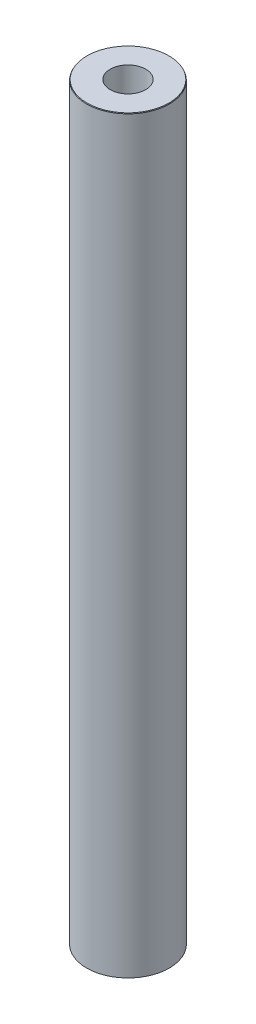
ISO-10303-21;
HEADER;
FILE_DESCRIPTION(('STEP AP214'),'2;1');
FILE_NAME('part.step','',(''),(''),'','','');
FILE_SCHEMA(('AUTOMOTIVE_DESIGN { 1 0 10303 214 1 1 1 1 }'));
ENDSEC;
DATA;
#1=APPLICATION_CONTEXT('core data for automotive mechanical design processes');
#2=APPLICATION_PROTOCOL_DEFINITION('international standard','automotive_design',2000,#1);
#3=PRODUCT_CONTEXT('',#1,'mechanical');
#4=PRODUCT('Part','Part','',(#3));
#5=PRODUCT_RELATED_PRODUCT_CATEGORY('part','',(#4));
#6=PRODUCT_DEFINITION_FORMATION('','',#4);
#7=PRODUCT_DEFINITION_CONTEXT('part definition',#1,'design');
#8=PRODUCT_DEFINITION('design','',#6,#7);
#9=PRODUCT_DEFINITION_SHAPE('','',#8);
#10=(LENGTH_UNIT() NAMED_UNIT(*) SI_UNIT(.MILLI.,.METRE.));
#11=(NAMED_UNIT(*) PLANE_ANGLE_UNIT() SI_UNIT($,.RADIAN.));
#12=(NAMED_UNIT(*) SI_UNIT($,.STERADIAN.) SOLID_ANGLE_UNIT());
#13=UNCERTAINTY_MEASURE_WITH_UNIT(LENGTH_MEASURE(1.E-05),#10,'distance_accuracy_value','');
#14=(GEOMETRIC_REPRESENTATION_CONTEXT(3) GLOBAL_UNCERTAINTY_ASSIGNED_CONTEXT((#13)) GLOBAL_UNIT_ASSIGNED_CONTEXT((#10,
#11,#12)) REPRESENTATION_CONTEXT('',''));
#15=CARTESIAN_POINT('',(0.,0.,0.));
#16=DIRECTION('',(0.,0.,1.));
#17=DIRECTION('',(1.,0.,0.));
#18=AXIS2_PLACEMENT_3D('',#15,#16,#17);
#19=CARTESIAN_POINT('',(0.,453.36951955745,0.));
#20=DIRECTION('',(0.,-1.,0.));
#21=DIRECTION('',(0.,0.,-1.));
#22=AXIS2_PLACEMENT_3D('',#19,#20,#21);
#23=CYLINDRICAL_SURFACE('',#22,25.);
#24=CARTESIAN_POINT('',(0.,452.968552783808,0.));
#25=DIRECTION('',(0.,1.,0.));
#26=DIRECTION('',(0.,0.,1.));
#27=AXIS2_PLACEMENT_3D('',#24,#25,#26);
#28=CIRCLE('',#27,25.);
#29=CARTESIAN_POINT('',(0.,452.968552783808,25.));
#30=VERTEX_POINT('',#29);
#31=EDGE_CURVE('E50',#30,#30,#28,.F.);
#32=ORIENTED_EDGE('',*,*,#31,.T.);
#33=EDGE_LOOP('',(#32));
#34=FACE_BOUND('',#33,.T.);
#35=CARTESIAN_POINT('',(0.,0.23149827469876,0.));
#36=DIRECTION('',(0.,1.,0.));
#37=DIRECTION('',(0.,0.,1.));
#38=AXIS2_PLACEMENT_3D('',#35,#36,#37);
#39=CIRCLE('',#38,25.);
#40=CARTESIAN_POINT('',(0.,0.23149827469876,25.));
#41=VERTEX_POINT('',#40);
#42=EDGE_CURVE('E51',#41,#41,#39,.T.);
#43=ORIENTED_EDGE('',*,*,#42,.T.);
#44=EDGE_LOOP('',(#43));
#45=FACE_BOUND('',#44,.T.);
#46=ADVANCED_FACE('F39',(#34,#45),#23,.T.);
#47=CARTESIAN_POINT('',(0.,453.36951955745,0.));
#48=DIRECTION('',(0.,1.,0.));
#49=DIRECTION('',(0.,0.,1.));
#50=AXIS2_PLACEMENT_3D('',#47,#48,#49);
#51=PLANE('',#50);
#52=CARTESIAN_POINT('',(0.,453.36951955745,0.));
#53=DIRECTION('',(0.,1.,0.));
#54=DIRECTION('',(0.,0.,1.));
#55=AXIS2_PLACEMENT_3D('',#52,#53,#54);
#56=CIRCLE('',#55,24.7685017253012);
#57=CARTESIAN_POINT('',(0.,453.36951955745,24.7685017253012));
#58=VERTEX_POINT('',#57);
#59=EDGE_CURVE('E54',#58,#58,#56,.T.);
#60=ORIENTED_EDGE('',*,*,#59,.T.);
#61=EDGE_LOOP('',(#60));
#62=FACE_BOUND('',#61,.T.);
#63=CARTESIAN_POINT('',(0.,453.36951955745,0.));
#64=DIRECTION('',(0.,1.,0.));
#65=DIRECTION('',(0.,0.,1.));
#66=AXIS2_PLACEMENT_3D('',#63,#64,#65);
#67=CIRCLE('',#66,10.761992849074);
#68=CARTESIAN_POINT('',(0.,453.36951955745,10.761992849074));
#69=VERTEX_POINT('',#68);
#70=EDGE_CURVE('E58',#69,#69,#67,.T.);
#71=ORIENTED_EDGE('',*,*,#70,.F.);
#72=EDGE_LOOP('',(#71));
#73=FACE_BOUND('',#72,.T.);
#74=ADVANCED_FACE('F69',(#62,#73),#51,.T.);
#75=CARTESIAN_POINT('',(0.,0.,0.));
#76=DIRECTION('',(0.,1.,0.));
#77=DIRECTION('',(0.,0.,1.));
#78=AXIS2_PLACEMENT_3D('',#75,#76,#77);
#79=PLANE('',#78);
#80=CARTESIAN_POINT('',(0.,0.,0.));
#81=DIRECTION('',(0.,1.,0.));
#82=DIRECTION('',(0.,0.,1.));
#83=AXIS2_PLACEMENT_3D('',#80,#81,#82);
#84=CIRCLE('',#83,24.5990332263572);
#85=CARTESIAN_POINT('',(0.,0.,24.5990332263572));
#86=VERTEX_POINT('',#85);
#87=EDGE_CURVE('E10',#86,#86,#84,.F.);
#88=ORIENTED_EDGE('',*,*,#87,.T.);
#89=EDGE_LOOP('',(#88));
#90=FACE_BOUND('',#89,.T.);
#91=CARTESIAN_POINT('',(0.,0.,0.));
#92=DIRECTION('',(0.,1.,0.));
#93=DIRECTION('',(0.,0.,1.));
#94=AXIS2_PLACEMENT_3D('',#91,#92,#93);
#95=CIRCLE('',#94,10.761992849074);
#96=CARTESIAN_POINT('',(0.,0.,10.761992849074));
#97=VERTEX_POINT('',#96);
#98=EDGE_CURVE('E63',#97,#97,#95,.T.);
#99=ORIENTED_EDGE('',*,*,#98,.T.);
#100=EDGE_LOOP('',(#99));
#101=FACE_BOUND('',#100,.T.);
#102=ADVANCED_FACE('F75',(#90,#101),#79,.F.);
#103=CARTESIAN_POINT('',(0.,453.36951955745,0.));
#104=DIRECTION('',(0.,-1.,0.));
#105=DIRECTION('',(0.,0.,-1.));
#106=AXIS2_PLACEMENT_3D('',#103,#104,#105);
#107=CYLINDRICAL_SURFACE('',#106,10.761992849074);
#108=ORIENTED_EDGE('',*,*,#70,.T.);
#109=EDGE_LOOP('',(#108));
#110=FACE_BOUND('',#109,.T.);
#111=ORIENTED_EDGE('',*,*,#98,.F.);
#112=EDGE_LOOP('',(#111));
#113=FACE_BOUND('',#112,.T.);
#114=ADVANCED_FACE('F70',(#110,#113),#107,.F.);
#115=CARTESIAN_POINT('',(0.,453.36951955745,0.));
#116=DIRECTION('',(0.,-1.,0.));
#117=DIRECTION('',(0.,0.,-1.));
#118=AXIS2_PLACEMENT_3D('',#115,#116,#117);
#119=CONICAL_SURFACE('',#118,24.7685017253012,0.52359877559834);
#120=ORIENTED_EDGE('',*,*,#31,.F.);
#121=EDGE_LOOP('',(#120));
#122=FACE_BOUND('',#121,.T.);
#123=ORIENTED_EDGE('',*,*,#59,.F.);
#124=EDGE_LOOP('',(#123));
#125=FACE_BOUND('',#124,.T.);
#126=ADVANCED_FACE('F81',(#122,#125),#119,.T.);
#127=CARTESIAN_POINT('',(0.,0.23149827469876,0.));
#128=DIRECTION('',(0.,1.,0.));
#129=DIRECTION('',(0.,0.,1.));
#130=AXIS2_PLACEMENT_3D('',#127,#128,#129);
#131=CONICAL_SURFACE('',#130,25.,1.04719755119661);
#132=ORIENTED_EDGE('',*,*,#87,.F.);
#133=EDGE_LOOP('',(#132));
#134=FACE_BOUND('',#133,.T.);
#135=ORIENTED_EDGE('',*,*,#42,.F.);
#136=EDGE_LOOP('',(#135));
#137=FACE_BOUND('',#136,.T.);
#138=ADVANCED_FACE('F45',(#134,#137),#131,.T.);
#139=CLOSED_SHELL('',(#46,#74,#102,#114,#126,#138));
#140=MANIFOLD_SOLID_BREP('B2',#139);
#141=ADVANCED_BREP_SHAPE_REPRESENTATION('',(#18,#140),#14);
#142=SHAPE_DEFINITION_REPRESENTATION(#9,#141);
ENDSEC;
END-ISO-10303-21;
